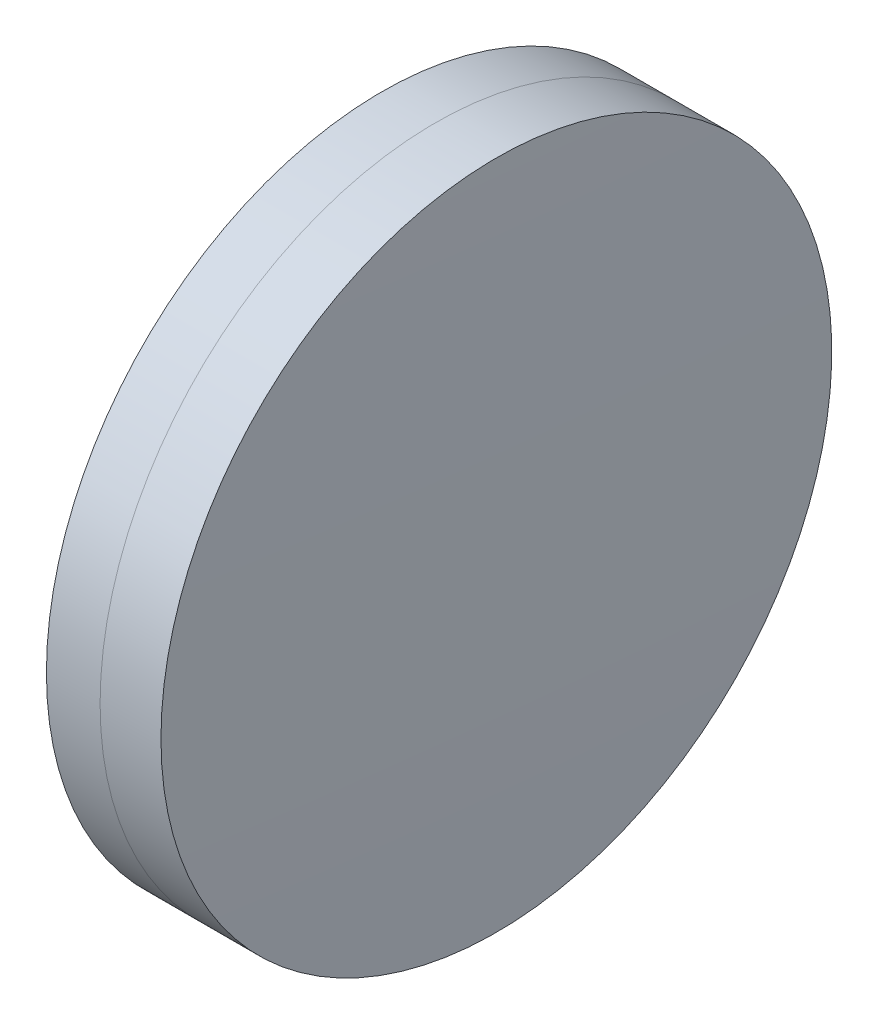
ISO-10303-21;
HEADER;
FILE_DESCRIPTION(('STEP AP214'),'2;1');
FILE_NAME('part.step','',(''),(''),'','','');
FILE_SCHEMA(('AUTOMOTIVE_DESIGN { 1 0 10303 214 1 1 1 1 }'));
ENDSEC;
DATA;
#1=APPLICATION_CONTEXT('core data for automotive mechanical design processes');
#2=APPLICATION_PROTOCOL_DEFINITION('international standard','automotive_design',2000,#1);
#3=PRODUCT_CONTEXT('',#1,'mechanical');
#4=PRODUCT('Part','Part','',(#3));
#5=PRODUCT_RELATED_PRODUCT_CATEGORY('part','',(#4));
#6=PRODUCT_DEFINITION_FORMATION('','',#4);
#7=PRODUCT_DEFINITION_CONTEXT('part definition',#1,'design');
#8=PRODUCT_DEFINITION('design','',#6,#7);
#9=PRODUCT_DEFINITION_SHAPE('','',#8);
#10=(LENGTH_UNIT() NAMED_UNIT(*) SI_UNIT(.MILLI.,.METRE.));
#11=(NAMED_UNIT(*) PLANE_ANGLE_UNIT() SI_UNIT($,.RADIAN.));
#12=(NAMED_UNIT(*) SI_UNIT($,.STERADIAN.) SOLID_ANGLE_UNIT());
#13=UNCERTAINTY_MEASURE_WITH_UNIT(LENGTH_MEASURE(1.E-05),#10,'distance_accuracy_value','');
#14=(GEOMETRIC_REPRESENTATION_CONTEXT(3) GLOBAL_UNCERTAINTY_ASSIGNED_CONTEXT((#13)) GLOBAL_UNIT_ASSIGNED_CONTEXT((#10,
#11,#12)) REPRESENTATION_CONTEXT('',''));
#15=CARTESIAN_POINT('',(0.,0.,0.));
#16=DIRECTION('',(0.,0.,1.));
#17=DIRECTION('',(1.,0.,0.));
#18=AXIS2_PLACEMENT_3D('',#15,#16,#17);
#19=CARTESIAN_POINT('',(14.8796689735747,0.,0.));
#20=DIRECTION('',(-1.,0.,0.));
#21=DIRECTION('',(0.,0.,1.));
#22=AXIS2_PLACEMENT_3D('',#19,#20,#21);
#23=SPHERICAL_SURFACE('',#22,203.);
#24=CARTESIAN_POINT('',(217.494451257593,0.,0.));
#25=DIRECTION('',(-1.,0.,0.));
#26=DIRECTION('',(0.,0.,1.));
#27=AXIS2_PLACEMENT_3D('',#24,#25,#26);
#28=CIRCLE('',#27,12.5000000000001);
#29=CARTESIAN_POINT('',(217.494451257593,0.,12.5000000000001));
#30=VERTEX_POINT('',#29);
#31=EDGE_CURVE('E11',#30,#30,#28,.T.);
#32=ORIENTED_EDGE('',*,*,#31,.T.);
#33=EDGE_LOOP('',(#32));
#34=FACE_BOUND('',#33,.T.);
#35=ADVANCED_FACE('F45',(#34),#23,.F.);
#36=CARTESIAN_POINT('',(-0.551919992657797,0.,0.));
#37=DIRECTION('',(-1.,0.,0.));
#38=DIRECTION('',(0.,0.,1.));
#39=AXIS2_PLACEMENT_3D('',#36,#37,#38);
#40=CYLINDRICAL_SURFACE('',#39,12.5);
#41=CARTESIAN_POINT('',(219.763019520682,0.,0.));
#42=DIRECTION('',(-1.,0.,0.));
#43=DIRECTION('',(0.,0.,1.));
#44=AXIS2_PLACEMENT_3D('',#41,#42,#43);
#45=CIRCLE('',#44,12.4999999999999);
#46=CARTESIAN_POINT('',(219.763019520682,0.,12.4999999999999));
#47=VERTEX_POINT('',#46);
#48=EDGE_CURVE('E51',#47,#47,#45,.T.);
#49=ORIENTED_EDGE('',*,*,#48,.T.);
#50=EDGE_LOOP('',(#49));
#51=FACE_BOUND('',#50,.T.);
#52=ORIENTED_EDGE('',*,*,#31,.F.);
#53=EDGE_LOOP('',(#52));
#54=FACE_BOUND('',#53,.T.);
#55=ADVANCED_FACE('F57',(#51,#54),#40,.T.);
#56=CARTESIAN_POINT('',(-449.920331026425,0.,0.));
#57=DIRECTION('',(-1.,0.,0.));
#58=DIRECTION('',(0.,0.,1.));
#59=AXIS2_PLACEMENT_3D('',#56,#57,#58);
#60=SPHERICAL_SURFACE('',#59,669.8);
#61=ORIENTED_EDGE('',*,*,#48,.F.);
#62=EDGE_LOOP('',(#61));
#63=FACE_BOUND('',#62,.T.);
#64=ADVANCED_FACE('F60',(#63),#60,.T.);
#65=CLOSED_SHELL('',(#35,#55,#64));
#66=MANIFOLD_SOLID_BREP('B2',#65);
#67=CARTESIAN_POINT('',(522.239668973575,0.,0.));
#68=DIRECTION('',(-1.,0.,0.));
#69=DIRECTION('',(0.,0.,1.));
#70=AXIS2_PLACEMENT_3D('',#67,#68,#69);
#71=SPHERICAL_SURFACE('',#70,307.);
#72=CARTESIAN_POINT('',(215.49425335991,0.,0.));
#73=DIRECTION('',(-1.,0.,0.));
#74=DIRECTION('',(0.,0.,1.));
#75=AXIS2_PLACEMENT_3D('',#72,#73,#74);
#76=CIRCLE('',#75,12.5);
#77=CARTESIAN_POINT('',(215.49425335991,0.,12.5));
#78=VERTEX_POINT('',#77);
#79=EDGE_CURVE('E44',#78,#78,#76,.T.);
#80=ORIENTED_EDGE('',*,*,#79,.T.);
#81=EDGE_LOOP('',(#80));
#82=FACE_BOUND('',#81,.T.);
#83=ADVANCED_FACE('F86',(#82),#71,.T.);
#84=CARTESIAN_POINT('',(-9.70261217833668,0.,0.));
#85=DIRECTION('',(-1.,0.,0.));
#86=DIRECTION('',(0.,0.,1.));
#87=AXIS2_PLACEMENT_3D('',#84,#85,#86);
#88=CYLINDRICAL_SURFACE('',#87,12.5);
#89=CARTESIAN_POINT('',(217.494451257593,0.,0.));
#90=DIRECTION('',(-1.,0.,0.));
#91=DIRECTION('',(0.,0.,1.));
#92=AXIS2_PLACEMENT_3D('',#89,#90,#91);
#93=CIRCLE('',#92,12.5);
#94=CARTESIAN_POINT('',(217.494451257593,0.,12.5));
#95=VERTEX_POINT('',#94);
#96=EDGE_CURVE('E92',#95,#95,#93,.T.);
#97=ORIENTED_EDGE('',*,*,#96,.T.);
#98=EDGE_LOOP('',(#97));
#99=FACE_BOUND('',#98,.T.);
#100=ORIENTED_EDGE('',*,*,#79,.F.);
#101=EDGE_LOOP('',(#100));
#102=FACE_BOUND('',#101,.T.);
#103=ADVANCED_FACE('F98',(#99,#102),#88,.T.);
#104=CARTESIAN_POINT('',(14.8796689735747,0.,0.));
#105=DIRECTION('',(-1.,0.,0.));
#106=DIRECTION('',(0.,0.,1.));
#107=AXIS2_PLACEMENT_3D('',#104,#105,#106);
#108=SPHERICAL_SURFACE('',#107,203.);
#109=ORIENTED_EDGE('',*,*,#96,.F.);
#110=EDGE_LOOP('',(#109));
#111=FACE_BOUND('',#110,.T.);
#112=ADVANCED_FACE('F101',(#111),#108,.T.);
#113=CLOSED_SHELL('',(#83,#103,#112));
#114=MANIFOLD_SOLID_BREP('B6',#113);
#115=ADVANCED_BREP_SHAPE_REPRESENTATION('',(#18,#66,#114),#14);
#116=SHAPE_DEFINITION_REPRESENTATION(#9,#115);
ENDSEC;
END-ISO-10303-21;
